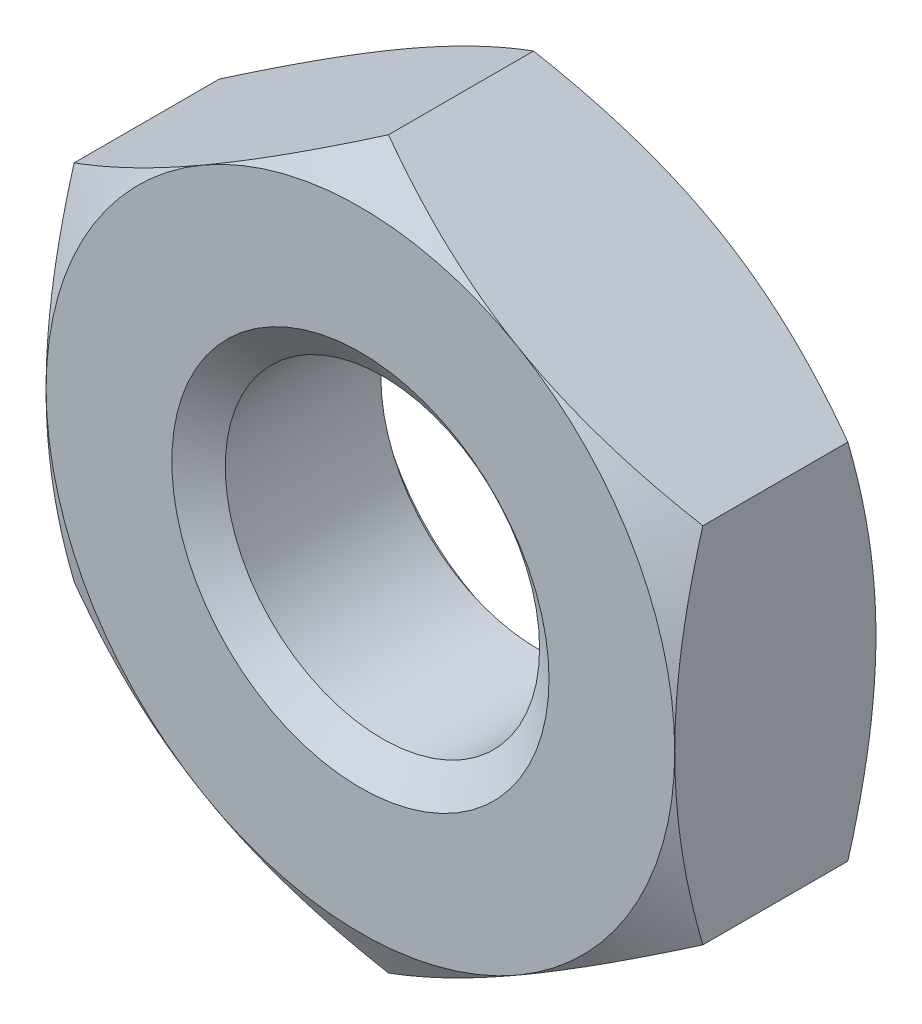
ISO-10303-21;
HEADER;
FILE_DESCRIPTION(('STEP AP214'),'2;1');
FILE_NAME('part.step','',(''),(''),'','','');
FILE_SCHEMA(('AUTOMOTIVE_DESIGN { 1 0 10303 214 1 1 1 1 }'));
ENDSEC;
DATA;
#1=APPLICATION_CONTEXT('core data for automotive mechanical design processes');
#2=APPLICATION_PROTOCOL_DEFINITION('international standard','automotive_design',2000,#1);
#3=PRODUCT_CONTEXT('',#1,'mechanical');
#4=PRODUCT('Part','Part','',(#3));
#5=PRODUCT_RELATED_PRODUCT_CATEGORY('part','',(#4));
#6=PRODUCT_DEFINITION_FORMATION('','',#4);
#7=PRODUCT_DEFINITION_CONTEXT('part definition',#1,'design');
#8=PRODUCT_DEFINITION('design','',#6,#7);
#9=PRODUCT_DEFINITION_SHAPE('','',#8);
#10=(LENGTH_UNIT() NAMED_UNIT(*) SI_UNIT(.MILLI.,.METRE.));
#11=(NAMED_UNIT(*) PLANE_ANGLE_UNIT() SI_UNIT($,.RADIAN.));
#12=(NAMED_UNIT(*) SI_UNIT($,.STERADIAN.) SOLID_ANGLE_UNIT());
#13=UNCERTAINTY_MEASURE_WITH_UNIT(LENGTH_MEASURE(1.E-05),#10,'distance_accuracy_value','');
#14=(GEOMETRIC_REPRESENTATION_CONTEXT(3) GLOBAL_UNCERTAINTY_ASSIGNED_CONTEXT((#13)) GLOBAL_UNIT_ASSIGNED_CONTEXT((#10,
#11,#12)) REPRESENTATION_CONTEXT('',''));
#15=CARTESIAN_POINT('',(0.,0.,0.));
#16=DIRECTION('',(0.,0.,1.));
#17=DIRECTION('',(1.,0.,0.));
#18=AXIS2_PLACEMENT_3D('',#15,#16,#17);
#19=CARTESIAN_POINT('',(0.,0.,-3.2));
#20=DIRECTION('',(0.,0.,1.));
#21=DIRECTION('',(1.,0.,0.));
#22=AXIS2_PLACEMENT_3D('',#19,#20,#21);
#23=CYLINDRICAL_SURFACE('',#22,2.5);
#24=CARTESIAN_POINT('',(0.,0.,-0.350103769104855));
#25=DIRECTION('',(0.,0.,1.));
#26=DIRECTION('',(1.,0.,0.));
#27=AXIS2_PLACEMENT_3D('',#24,#25,#26);
#28=CIRCLE('',#27,2.5);
#29=CARTESIAN_POINT('',(2.5,0.,-0.350103769104855));
#30=VERTEX_POINT('',#29);
#31=EDGE_CURVE('E176',#30,#30,#28,.F.);
#32=ORIENTED_EDGE('',*,*,#31,.F.);
#33=EDGE_LOOP('',(#32));
#34=FACE_BOUND('',#33,.T.);
#35=CARTESIAN_POINT('',(0.,0.,-2.82449623089514));
#36=DIRECTION('',(0.,0.,-1.));
#37=DIRECTION('',(-1.,0.,0.));
#38=AXIS2_PLACEMENT_3D('',#35,#36,#37);
#39=CIRCLE('',#38,2.5);
#40=CARTESIAN_POINT('',(-2.5,0.,-2.82449623089514));
#41=VERTEX_POINT('',#40);
#42=EDGE_CURVE('E41',#41,#41,#39,.F.);
#43=ORIENTED_EDGE('',*,*,#42,.F.);
#44=EDGE_LOOP('',(#43));
#45=FACE_BOUND('',#44,.T.);
#46=ADVANCED_FACE('F36',(#34,#45),#23,.F.);
#47=CARTESIAN_POINT('',(0.,5.77350269189626,-3.2));
#48=DIRECTION('',(0.,0.,-1.));
#49=DIRECTION('',(-1.,0.,0.));
#50=AXIS2_PLACEMENT_3D('',#47,#48,#49);
#51=PLANE('',#50);
#52=CARTESIAN_POINT('',(0.,0.,-3.2));
#53=DIRECTION('',(0.,0.,-1.));
#54=DIRECTION('',(-1.,0.,0.));
#55=AXIS2_PLACEMENT_3D('',#52,#53,#54);
#56=CIRCLE('',#55,5.);
#57=CARTESIAN_POINT('',(-5.,0.,-3.2));
#58=VERTEX_POINT('',#57);
#59=CARTESIAN_POINT('',(-2.5,-4.33012701892219,-3.2));
#60=VERTEX_POINT('',#59);
#61=EDGE_CURVE('E172',#58,#60,#56,.F.);
#62=ORIENTED_EDGE('',*,*,#61,.F.);
#63=CARTESIAN_POINT('',(-2.5,4.33012701892219,-3.2));
#64=VERTEX_POINT('',#63);
#65=EDGE_CURVE('E154',#64,#58,#56,.F.);
#66=ORIENTED_EDGE('',*,*,#65,.F.);
#67=CARTESIAN_POINT('',(2.5,4.33012701892219,-3.2));
#68=VERTEX_POINT('',#67);
#69=EDGE_CURVE('E171',#68,#64,#56,.F.);
#70=ORIENTED_EDGE('',*,*,#69,.F.);
#71=CARTESIAN_POINT('',(0.,0.,-3.2));
#72=DIRECTION('',(0.,0.,1.));
#73=DIRECTION('',(1.,0.,0.));
#74=AXIS2_PLACEMENT_3D('',#71,#72,#73);
#75=CIRCLE('',#74,5.);
#76=CARTESIAN_POINT('',(5.,0.,-3.2));
#77=VERTEX_POINT('',#76);
#78=EDGE_CURVE('E246',#77,#68,#75,.T.);
#79=ORIENTED_EDGE('',*,*,#78,.F.);
#80=CARTESIAN_POINT('',(2.5,-4.33012701892219,-3.2));
#81=VERTEX_POINT('',#80);
#82=EDGE_CURVE('E362',#81,#77,#56,.F.);
#83=ORIENTED_EDGE('',*,*,#82,.F.);
#84=EDGE_CURVE('E366',#60,#81,#56,.F.);
#85=ORIENTED_EDGE('',*,*,#84,.F.);
#86=EDGE_LOOP('',(#62,#66,#70,#79,#83,#85));
#87=FACE_BOUND('',#86,.T.);
#88=CARTESIAN_POINT('',(0.,0.,-3.2));
#89=DIRECTION('',(0.,0.,-1.));
#90=DIRECTION('',(-1.,0.,0.));
#91=AXIS2_PLACEMENT_3D('',#88,#89,#90);
#92=CIRCLE('',#91,3.);
#93=CARTESIAN_POINT('',(-3.,0.,-3.2));
#94=VERTEX_POINT('',#93);
#95=EDGE_CURVE('E179',#94,#94,#92,.F.);
#96=ORIENTED_EDGE('',*,*,#95,.T.);
#97=EDGE_LOOP('',(#96));
#98=FACE_BOUND('',#97,.T.);
#99=ADVANCED_FACE('F299',(#87,#98),#51,.T.);
#100=CARTESIAN_POINT('',(0.,5.77350269189626,0.));
#101=DIRECTION('',(0.,0.,-1.));
#102=DIRECTION('',(-1.,0.,0.));
#103=AXIS2_PLACEMENT_3D('',#100,#101,#102);
#104=PLANE('',#103);
#105=CARTESIAN_POINT('',(0.,0.,0.));
#106=DIRECTION('',(0.,0.,-1.));
#107=DIRECTION('',(-1.,0.,0.));
#108=AXIS2_PLACEMENT_3D('',#105,#106,#107);
#109=CIRCLE('',#108,5.);
#110=CARTESIAN_POINT('',(-5.,0.,0.));
#111=VERTEX_POINT('',#110);
#112=CARTESIAN_POINT('',(-2.5,4.33012701892219,0.));
#113=VERTEX_POINT('',#112);
#114=EDGE_CURVE('E11',#111,#113,#109,.T.);
#115=ORIENTED_EDGE('',*,*,#114,.F.);
#116=CARTESIAN_POINT('',(-2.5,-4.33012701892219,0.));
#117=VERTEX_POINT('',#116);
#118=EDGE_CURVE('E48',#117,#111,#109,.T.);
#119=ORIENTED_EDGE('',*,*,#118,.F.);
#120=CARTESIAN_POINT('',(2.5,-4.33012701892219,0.));
#121=VERTEX_POINT('',#120);
#122=EDGE_CURVE('E175',#121,#117,#109,.T.);
#123=ORIENTED_EDGE('',*,*,#122,.F.);
#124=CARTESIAN_POINT('',(5.,0.,0.));
#125=VERTEX_POINT('',#124);
#126=EDGE_CURVE('E353',#125,#121,#109,.T.);
#127=ORIENTED_EDGE('',*,*,#126,.F.);
#128=CARTESIAN_POINT('',(0.,0.,0.));
#129=DIRECTION('',(0.,0.,1.));
#130=DIRECTION('',(1.,0.,0.));
#131=AXIS2_PLACEMENT_3D('',#128,#129,#130);
#132=CIRCLE('',#131,5.);
#133=CARTESIAN_POINT('',(2.5,4.33012701892219,0.));
#134=VERTEX_POINT('',#133);
#135=EDGE_CURVE('E130',#125,#134,#132,.T.);
#136=ORIENTED_EDGE('',*,*,#135,.T.);
#137=EDGE_CURVE('E46',#113,#134,#109,.T.);
#138=ORIENTED_EDGE('',*,*,#137,.F.);
#139=EDGE_LOOP('',(#115,#119,#123,#127,#136,#138));
#140=FACE_BOUND('',#139,.T.);
#141=CARTESIAN_POINT('',(0.,0.,0.));
#142=DIRECTION('',(0.,0.,1.));
#143=DIRECTION('',(1.,0.,0.));
#144=AXIS2_PLACEMENT_3D('',#141,#142,#143);
#145=CIRCLE('',#144,3.);
#146=CARTESIAN_POINT('',(3.,0.,0.));
#147=VERTEX_POINT('',#146);
#148=EDGE_CURVE('E178',#147,#147,#145,.T.);
#149=ORIENTED_EDGE('',*,*,#148,.F.);
#150=EDGE_LOOP('',(#149));
#151=FACE_BOUND('',#150,.T.);
#152=ADVANCED_FACE('F251',(#140,#151),#104,.F.);
#153=CARTESIAN_POINT('',(0.,5.77350269189626,-3.2));
#154=DIRECTION('',(-0.500000000000001,0.866025403784438,0.));
#155=DIRECTION('',(-0.866025403784438,-0.500000000000001,0.));
#156=AXIS2_PLACEMENT_3D('',#153,#154,#155);
#157=PLANE('',#156);
#158=DIRECTION('',(0.,0.,1.));
#159=VECTOR('',#158,1.);
#160=CARTESIAN_POINT('',(-5.,2.88675134594813,-3.2));
#161=LINE('',#160,#159);
#162=CARTESIAN_POINT('',(-5.,2.88675134594813,-2.75341801261479));
#163=VERTEX_POINT('',#162);
#164=CARTESIAN_POINT('',(-5.,2.88675134594813,-0.446581987385205));
#165=VERTEX_POINT('',#164);
#166=EDGE_CURVE('E166',#163,#165,#161,.T.);
#167=ORIENTED_EDGE('',*,*,#166,.T.);
#168=CARTESIAN_POINT('',(-5.0002,2.88663587589429,-0.446648656051832));
#169=CARTESIAN_POINT('',(-4.78046540547481,3.01349970319368,-0.373386567637637));
#170=CARTESIAN_POINT('',(-4.55885141554042,3.14144859993849,-0.306751321918094));
#171=CARTESIAN_POINT('',(-4.11178600454649,3.39956193532121,-0.190438991010811));
#172=CARTESIAN_POINT('',(-3.88632664040923,3.52973095989718,-0.140803049915789));
#173=CARTESIAN_POINT('',(-3.43816769477649,3.78847564779798,-0.0635510254186975));
#174=CARTESIAN_POINT('',(-3.21553790689581,3.91701101576052,-0.0354203782834889));
#175=CARTESIAN_POINT('',(-2.88081009815336,4.11026620624323,-0.010194921953684));
#176=CARTESIAN_POINT('',(-2.76915780319494,4.17472868879311,-0.00461345976948341));
#177=CARTESIAN_POINT('',(-2.5457500293262,4.30371322717528,0.000797783248530168));
#178=CARTESIAN_POINT('',(-2.43399455370968,4.36823528110589,0.000627741741796764));
#179=CARTESIAN_POINT('',(-2.12781576914936,4.54500768479195,-0.00775363179203697));
#180=CARTESIAN_POINT('',(-1.93349391403278,4.65719946015293,-0.0218297718972522));
#181=CARTESIAN_POINT('',(-1.54613989800229,4.88083840557981,-0.0664652571094323));
#182=CARTESIAN_POINT('',(-1.35310909862843,4.9922847895602,-0.0970398601475101));
#183=CARTESIAN_POINT('',(-0.964974657525144,5.21637431361295,-0.173468493621167));
#184=CARTESIAN_POINT('',(-0.769920001358263,5.32898917185759,-0.219646378878683));
#185=CARTESIAN_POINT('',(-0.382719654641231,5.55253939626498,-0.324451794491938));
#186=CARTESIAN_POINT('',(-0.190569004591913,5.66347762579592,-0.383054703437379));
#187=CARTESIAN_POINT('',(0.000199999999999885,5.7736181619501,-0.446648656051834));
#188=B_SPLINE_CURVE_WITH_KNOTS('',3,(#168,#169,#170,#171,#172,#173,#174,#175,#176,#177,#178,
#179,#180,#181,#182,#183,#184,#185,#186,#187),.UNSPECIFIED.,.F.,.F.,(4,2,2,2,2,2,2,2,2,4),(0.,
0.792555841363092,1.58701660053334,2.36181537487281,2.74884076077326,3.13585419177295,
3.8096236259968,4.4840172390119,5.17336882348929,5.86136694793726),.UNSPECIFIED.);
#189=EDGE_CURVE('E135',#165,#113,#188,.T.);
#190=ORIENTED_EDGE('',*,*,#189,.T.);
#191=CARTESIAN_POINT('',(0.,5.77350269189626,-0.446581987385208));
#192=VERTEX_POINT('',#191);
#193=EDGE_CURVE('E55',#113,#192,#188,.T.);
#194=ORIENTED_EDGE('',*,*,#193,.T.);
#195=DIRECTION('',(0.,0.,1.));
#196=VECTOR('',#195,1.);
#197=CARTESIAN_POINT('',(0.,5.77350269189626,-3.2));
#198=LINE('',#197,#196);
#199=CARTESIAN_POINT('',(0.,5.77350269189626,-2.75341801261479));
#200=VERTEX_POINT('',#199);
#201=EDGE_CURVE('E151',#200,#192,#198,.T.);
#202=ORIENTED_EDGE('',*,*,#201,.F.);
#203=CARTESIAN_POINT('',(-5.0002,2.88663587589429,-2.75335134394817));
#204=CARTESIAN_POINT('',(-4.78046540547481,3.01349970319368,-2.82661343236236));
#205=CARTESIAN_POINT('',(-4.55885141554042,3.14144859993849,-2.89324867808191));
#206=CARTESIAN_POINT('',(-4.11178600454649,3.39956193532121,-3.00956100898919));
#207=CARTESIAN_POINT('',(-3.88632664040923,3.52973095989718,-3.05919695008421));
#208=CARTESIAN_POINT('',(-3.43816769477649,3.78847564779798,-3.1364489745813));
#209=CARTESIAN_POINT('',(-3.2155379068958,3.91701101576052,-3.16457962171651));
#210=CARTESIAN_POINT('',(-2.88081009815336,4.11026620624323,-3.18980507804632));
#211=CARTESIAN_POINT('',(-2.76915780319494,4.17472868879311,-3.19538654023052));
#212=CARTESIAN_POINT('',(-2.5457500293262,4.30371322717528,-3.20079778324853));
#213=CARTESIAN_POINT('',(-2.43399455370968,4.36823528110589,-3.2006277417418));
#214=CARTESIAN_POINT('',(-2.12781576914936,4.54500768479194,-3.19224636820796));
#215=CARTESIAN_POINT('',(-1.93349391403278,4.65719946015293,-3.17817022810275));
#216=CARTESIAN_POINT('',(-1.54613989800229,4.88083840557981,-3.13353474289057));
#217=CARTESIAN_POINT('',(-1.35310909862843,4.99228478956021,-3.10296013985249));
#218=CARTESIAN_POINT('',(-0.964974657525144,5.21637431361295,-3.02653150637883));
#219=CARTESIAN_POINT('',(-0.769920001358263,5.32898917185759,-2.98035362112132));
#220=CARTESIAN_POINT('',(-0.382719654641231,5.55253939626498,-2.87554820550806));
#221=CARTESIAN_POINT('',(-0.190569004591913,5.66347762579592,-2.81694529656262));
#222=CARTESIAN_POINT('',(0.000199999999999887,5.7736181619501,-2.75335134394817));
#223=B_SPLINE_CURVE_WITH_KNOTS('',3,(#203,#204,#205,#206,#207,#208,#209,#210,#211,#212,#213,
#214,#215,#216,#217,#218,#219,#220,#221,#222),.UNSPECIFIED.,.F.,.F.,(4,2,2,2,2,2,2,2,2,4),(0.,
0.792555841363092,1.58701660053334,2.36181537487281,2.74884076077326,3.13585419177295,
3.8096236259968,4.4840172390119,5.17336882348929,5.86136694793726),.UNSPECIFIED.);
#224=EDGE_CURVE('E169',#64,#200,#223,.T.);
#225=ORIENTED_EDGE('',*,*,#224,.F.);
#226=EDGE_CURVE('E261',#163,#64,#223,.T.);
#227=ORIENTED_EDGE('',*,*,#226,.F.);
#228=EDGE_LOOP('',(#167,#190,#194,#202,#225,#227));
#229=FACE_BOUND('',#228,.T.);
#230=ADVANCED_FACE('F38',(#229),#157,.T.);
#231=CARTESIAN_POINT('',(5.,2.88675134594813,-3.2));
#232=DIRECTION('',(0.500000000000001,0.866025403784438,0.));
#233=DIRECTION('',(-0.866025403784438,0.500000000000001,0.));
#234=AXIS2_PLACEMENT_3D('',#231,#232,#233);
#235=PLANE('',#234);
#236=ORIENTED_EDGE('',*,*,#201,.T.);
#237=CARTESIAN_POINT('',(-0.000199999999999944,5.7736181619501,-0.446648656051834));
#238=CARTESIAN_POINT('',(0.219534594525186,5.64675433465071,-0.37338656763764));
#239=CARTESIAN_POINT('',(0.441148584459581,5.5188054379059,-0.306751321918096));
#240=CARTESIAN_POINT('',(0.888213995453514,5.26069210252318,-0.190438991010813));
#241=CARTESIAN_POINT('',(1.11367335959078,5.13052307794721,-0.140803049915791));
#242=CARTESIAN_POINT('',(1.56183230522351,4.87177839004641,-0.0635510254186984));
#243=CARTESIAN_POINT('',(1.78446209310419,4.74324302208387,-0.0354203782834895));
#244=CARTESIAN_POINT('',(2.11918990184664,4.54998783160116,-0.0101949219536846));
#245=CARTESIAN_POINT('',(2.23084219680506,4.48552534905128,-0.00461345976948414));
#246=CARTESIAN_POINT('',(2.4542499706738,4.35654081066911,0.000797783248529637));
#247=CARTESIAN_POINT('',(2.56600544629032,4.2920187567385,0.00062774174179657));
#248=CARTESIAN_POINT('',(2.87218423085064,4.11524635305244,-0.00775363179203664));
#249=CARTESIAN_POINT('',(3.06650608596722,4.00305457769146,-0.021829771897252));
#250=CARTESIAN_POINT('',(3.45386010199771,3.77941563226457,-0.0664652571094318));
#251=CARTESIAN_POINT('',(3.64689090137157,3.66796924828418,-0.0970398601475091));
#252=CARTESIAN_POINT('',(4.03502534247486,3.44387972423144,-0.173468493621165));
#253=CARTESIAN_POINT('',(4.23007999864174,3.3312648659868,-0.219646378878682));
#254=CARTESIAN_POINT('',(4.61728034535877,3.1077146415794,-0.324451794491937));
#255=CARTESIAN_POINT('',(4.80943099540809,2.99677641204847,-0.383054703437377));
#256=CARTESIAN_POINT('',(5.0002,2.88663587589429,-0.446648656051832));
#257=B_SPLINE_CURVE_WITH_KNOTS('',3,(#237,#238,#239,#240,#241,#242,#243,#244,#245,#246,#247,
#248,#249,#250,#251,#252,#253,#254,#255,#256),.UNSPECIFIED.,.F.,.F.,(4,2,2,2,2,2,2,2,2,4),(0.,
0.792555841363092,1.58701660053334,2.36181537487281,2.74884076077326,3.13585419177296,
3.8096236259968,4.4840172390119,5.17336882348929,5.86136694793726),.UNSPECIFIED.);
#258=EDGE_CURVE('E145',#192,#134,#257,.T.);
#259=ORIENTED_EDGE('',*,*,#258,.T.);
#260=CARTESIAN_POINT('',(5.,2.88675134594813,-0.446581987385208));
#261=VERTEX_POINT('',#260);
#262=EDGE_CURVE('E62',#134,#261,#257,.T.);
#263=ORIENTED_EDGE('',*,*,#262,.T.);
#264=DIRECTION('',(0.,0.,1.));
#265=VECTOR('',#264,1.);
#266=CARTESIAN_POINT('',(5.,2.88675134594813,-3.2));
#267=LINE('',#266,#265);
#268=CARTESIAN_POINT('',(5.,2.88675134594813,-2.75341801261479));
#269=VERTEX_POINT('',#268);
#270=EDGE_CURVE('E144',#269,#261,#267,.T.);
#271=ORIENTED_EDGE('',*,*,#270,.F.);
#272=CARTESIAN_POINT('',(-0.00019999999999993,5.7736181619501,-2.75335134394817));
#273=CARTESIAN_POINT('',(0.219534594525186,5.64675433465071,-2.82661343236236));
#274=CARTESIAN_POINT('',(0.441148584459581,5.5188054379059,-2.8932486780819));
#275=CARTESIAN_POINT('',(0.888213995453514,5.26069210252318,-3.00956100898919));
#276=CARTESIAN_POINT('',(1.11367335959078,5.13052307794721,-3.05919695008421));
#277=CARTESIAN_POINT('',(1.56183230522351,4.87177839004641,-3.1364489745813));
#278=CARTESIAN_POINT('',(1.78446209310419,4.74324302208387,-3.16457962171651));
#279=CARTESIAN_POINT('',(2.11918990184664,4.54998783160116,-3.18980507804632));
#280=CARTESIAN_POINT('',(2.23084219680506,4.48552534905128,-3.19538654023052));
#281=CARTESIAN_POINT('',(2.4542499706738,4.35654081066911,-3.20079778324853));
#282=CARTESIAN_POINT('',(2.56600544629032,4.2920187567385,-3.2006277417418));
#283=CARTESIAN_POINT('',(2.87218423085064,4.11524635305244,-3.19224636820796));
#284=CARTESIAN_POINT('',(3.06650608596722,4.00305457769146,-3.17817022810275));
#285=CARTESIAN_POINT('',(3.45386010199771,3.77941563226457,-3.13353474289057));
#286=CARTESIAN_POINT('',(3.64689090137157,3.66796924828418,-3.10296013985249));
#287=CARTESIAN_POINT('',(4.03502534247486,3.44387972423144,-3.02653150637884));
#288=CARTESIAN_POINT('',(4.23007999864174,3.3312648659868,-2.98035362112132));
#289=CARTESIAN_POINT('',(4.61728034535877,3.1077146415794,-2.87554820550806));
#290=CARTESIAN_POINT('',(4.80943099540809,2.99677641204847,-2.81694529656262));
#291=CARTESIAN_POINT('',(5.0002,2.88663587589429,-2.75335134394817));
#292=B_SPLINE_CURVE_WITH_KNOTS('',3,(#272,#273,#274,#275,#276,#277,#278,#279,#280,#281,#282,
#283,#284,#285,#286,#287,#288,#289,#290,#291),.UNSPECIFIED.,.F.,.F.,(4,2,2,2,2,2,2,2,2,4),(0.,
0.792555841363092,1.58701660053334,2.36181537487281,2.74884076077326,3.13585419177296,
3.8096236259968,4.4840172390119,5.17336882348929,5.86136694793726),.UNSPECIFIED.);
#293=EDGE_CURVE('E255',#68,#269,#292,.T.);
#294=ORIENTED_EDGE('',*,*,#293,.F.);
#295=EDGE_CURVE('E260',#200,#68,#292,.T.);
#296=ORIENTED_EDGE('',*,*,#295,.F.);
#297=EDGE_LOOP('',(#236,#259,#263,#271,#294,#296));
#298=FACE_BOUND('',#297,.T.);
#299=ADVANCED_FACE('F142',(#298),#235,.T.);
#300=CARTESIAN_POINT('',(5.,2.88675134594813,-3.2));
#301=DIRECTION('',(-1.,0.,0.));
#302=DIRECTION('',(0.,0.,1.));
#303=AXIS2_PLACEMENT_3D('',#300,#301,#302);
#304=PLANE('',#303);
#305=CARTESIAN_POINT('',(5.,-7.65608998744865,-2.39263352655081));
#306=CARTESIAN_POINT('',(5.,-7.43656171400166,-2.28654533817208));
#307=CARTESIAN_POINT('',(5.,-7.21651440170022,-2.18151175461596));
#308=CARTESIAN_POINT('',(5.,-6.77510105921518,-1.97415643363977));
#309=CARTESIAN_POINT('',(5.,-6.55373480873053,-1.87183516574569));
#310=CARTESIAN_POINT('',(5.,-6.10820714710357,-1.66996807853491));
#311=CARTESIAN_POINT('',(5.,-5.88403698971124,-1.57044149281731));
#312=CARTESIAN_POINT('',(5.,-5.43385418074677,-1.37566323278682));
#313=CARTESIAN_POINT('',(5.,-5.20784162594278,-1.28041133564243));
#314=CARTESIAN_POINT('',(5.,-4.75080884782756,-1.09418830918942));
#315=CARTESIAN_POINT('',(5.,-4.51976121099505,-1.0032840909987));
#316=CARTESIAN_POINT('',(5.,-4.054940534221,-0.828595302971952));
#317=CARTESIAN_POINT('',(5.,-3.82116719434025,-0.744811525247655));
#318=CARTESIAN_POINT('',(5.,-3.35100416711889,-0.586614632364621));
#319=CARTESIAN_POINT('',(5.,-3.11462125088188,-0.512181595225273));
#320=CARTESIAN_POINT('',(5.,-2.63849247870023,-0.375104393872379));
#321=CARTESIAN_POINT('',(5.,-2.3987477121033,-0.31245650159695));
#322=CARTESIAN_POINT('',(5.,-1.91574303714497,-0.201987753994869));
#323=CARTESIAN_POINT('',(5.,-1.672482210841,-0.154170846558642));
#324=CARTESIAN_POINT('',(5.,-1.18299359688664,-0.0765955557924025));
#325=CARTESIAN_POINT('',(5.,-0.936765806613279,-0.0468371884284092));
#326=CARTESIAN_POINT('',(5.,-0.567032279323846,-0.0176512015862964));
#327=CARTESIAN_POINT('',(5.,-0.444105297658538,-0.0104963190599469));
#328=CARTESIAN_POINT('',(5.,-0.198053005238564,-0.00139545226904072));
#329=CARTESIAN_POINT('',(5.,-0.0749276970802274,0.000550599639614562));
#330=CARTESIAN_POINT('',(5.,0.171257999892354,-0.000818470345664083));
#331=CARTESIAN_POINT('',(5.,0.29431839722709,-0.00413211431301174));
#332=CARTESIAN_POINT('',(5.,0.540192730788842,-0.0159365972827602));
#333=CARTESIAN_POINT('',(5.,0.663006654263485,-0.0244276975701652));
#334=CARTESIAN_POINT('',(5.,0.960681872881669,-0.0511063802753011));
#335=CARTESIAN_POINT('',(5.,1.1353143627994,-0.0718889676982867));
#336=CARTESIAN_POINT('',(5.,1.48321675799389,-0.122765655722696));
#337=CARTESIAN_POINT('',(5.,1.65648647841236,-0.152860997990035));
#338=CARTESIAN_POINT('',(5.,2.00155426058699,-0.221298792011552));
#339=CARTESIAN_POINT('',(5.,2.17335067370373,-0.259649477486405));
#340=CARTESIAN_POINT('',(5.,2.51518168221054,-0.343428305385012));
#341=CARTESIAN_POINT('',(5.,2.6852163841931,-0.388856016914002));
#342=CARTESIAN_POINT('',(5.,3.02770318928892,-0.486887782054293));
#343=CARTESIAN_POINT('',(5.,3.20011248435311,-0.539640363823942));
#344=CARTESIAN_POINT('',(5.,3.54310870430176,-0.650357787302626));
#345=CARTESIAN_POINT('',(5.,3.71369679659714,-0.70831903390707));
#346=CARTESIAN_POINT('',(5.,4.05236610267973,-0.828256540728473));
#347=CARTESIAN_POINT('',(5.,4.22045602230055,-0.890208365426365));
#348=CARTESIAN_POINT('',(5.,4.55533171687448,-1.01774823413812));
#349=CARTESIAN_POINT('',(5.,4.72211693321414,-1.08333774778777));
#350=CARTESIAN_POINT('',(5.,4.88829623733355,-1.15038625817724));
#351=B_SPLINE_CURVE_WITH_KNOTS('',3,(#305,#306,#307,#308,#309,#310,#311,#312,#313,#314,#315,
#316,#317,#318,#319,#320,#321,#322,#323,#324,#325,#326,#327,#328,#329,#330,#331,#332,#333,#334,
#335,#336,#337,#338,#339,#340,#341,#342,#343,#344,#345,#346,#347,#348,#349,#350),.UNSPECIFIED.,
.F.,.F.,(4,2,2,2,2,2,2,2,2,2,2,2,2,2,2,2,2,2,2,2,2,2,4),(0.,0.731464740665351,1.46305528824908,
2.19883243307486,2.93457117856034,3.67934251246858,4.42419659013361,5.1674358087199,
5.91043951739339,6.65364083834807,7.39684281638516,7.76615414335457,8.13546067426611,
8.50466345177856,8.87388486298453,9.40118542949727,9.92855633110015,10.4564556797854,
10.9843228991235,11.525120280828,12.065547221064,12.6029322754131,13.1405360390026),.UNSPECIFIED.);
#352=CARTESIAN_POINT('',(5.,-2.88675134594813,-0.446581987385208));
#353=VERTEX_POINT('',#352);
#354=EDGE_CURVE('E137',#353,#125,#351,.T.);
#355=ORIENTED_EDGE('',*,*,#354,.F.);
#356=DIRECTION('',(0.,0.,1.));
#357=VECTOR('',#356,1.);
#358=CARTESIAN_POINT('',(5.,-2.88675134594813,-3.2));
#359=LINE('',#358,#357);
#360=CARTESIAN_POINT('',(5.,-2.88675134594813,-2.75341801261479));
#361=VERTEX_POINT('',#360);
#362=EDGE_CURVE('E152',#361,#353,#359,.T.);
#363=ORIENTED_EDGE('',*,*,#362,.F.);
#364=CARTESIAN_POINT('',(5.,-7.65608998744865,-0.807366473449195));
#365=CARTESIAN_POINT('',(5.,-7.43656171400166,-0.913454661827922));
#366=CARTESIAN_POINT('',(5.,-7.21651440170022,-1.01848824538404));
#367=CARTESIAN_POINT('',(5.,-6.77510105921518,-1.22584356636023));
#368=CARTESIAN_POINT('',(5.,-6.55373480873052,-1.32816483425431));
#369=CARTESIAN_POINT('',(5.,-6.10820714710357,-1.53003192146509));
#370=CARTESIAN_POINT('',(5.,-5.88403698971124,-1.62955850718269));
#371=CARTESIAN_POINT('',(5.,-5.43385418074677,-1.82433676721318));
#372=CARTESIAN_POINT('',(5.,-5.20784162594278,-1.91958866435757));
#373=CARTESIAN_POINT('',(5.,-4.75080884782756,-2.10581169081058));
#374=CARTESIAN_POINT('',(5.,-4.51976121099505,-2.1967159090013));
#375=CARTESIAN_POINT('',(5.,-4.05494053422099,-2.37140469702805));
#376=CARTESIAN_POINT('',(5.,-3.82116719434025,-2.45518847475235));
#377=CARTESIAN_POINT('',(5.,-3.35100416711889,-2.61338536763538));
#378=CARTESIAN_POINT('',(5.,-3.11462125088188,-2.68781840477473));
#379=CARTESIAN_POINT('',(5.,-2.63849247870023,-2.82489560612762));
#380=CARTESIAN_POINT('',(5.,-2.3987477121033,-2.88754349840305));
#381=CARTESIAN_POINT('',(5.,-1.91574303714497,-2.99801224600513));
#382=CARTESIAN_POINT('',(5.,-1.672482210841,-3.04582915344136));
#383=CARTESIAN_POINT('',(5.,-1.18299359688664,-3.1234044442076));
#384=CARTESIAN_POINT('',(5.,-0.936765806613281,-3.15316281157159));
#385=CARTESIAN_POINT('',(5.,-0.567032279323847,-3.1823487984137));
#386=CARTESIAN_POINT('',(5.,-0.444105297658539,-3.18950368094005));
#387=CARTESIAN_POINT('',(5.,-0.198053005238564,-3.19860454773096));
#388=CARTESIAN_POINT('',(5.,-0.0749276970802276,-3.20055059963961));
#389=CARTESIAN_POINT('',(5.,0.171257999892354,-3.19918152965434));
#390=CARTESIAN_POINT('',(5.,0.294318397227089,-3.19586788568699));
#391=CARTESIAN_POINT('',(5.,0.540192730788842,-3.18406340271724));
#392=CARTESIAN_POINT('',(5.,0.663006654263486,-3.17557230242983));
#393=CARTESIAN_POINT('',(5.,0.960681872881669,-3.1488936197247));
#394=CARTESIAN_POINT('',(5.,1.1353143627994,-3.12811103230171));
#395=CARTESIAN_POINT('',(5.,1.48321675799389,-3.0772343442773));
#396=CARTESIAN_POINT('',(5.,1.65648647841236,-3.04713900200997));
#397=CARTESIAN_POINT('',(5.,2.00155426058699,-2.97870120798845));
#398=CARTESIAN_POINT('',(5.,2.17335067370373,-2.9403505225136));
#399=CARTESIAN_POINT('',(5.,2.51518168221054,-2.85657169461499));
#400=CARTESIAN_POINT('',(5.,2.6852163841931,-2.811143983086));
#401=CARTESIAN_POINT('',(5.,3.02770318928892,-2.71311221794571));
#402=CARTESIAN_POINT('',(5.,3.20011248435311,-2.66035963617606));
#403=CARTESIAN_POINT('',(5.,3.54310870430176,-2.54964221269737));
#404=CARTESIAN_POINT('',(5.,3.71369679659714,-2.49168096609293));
#405=CARTESIAN_POINT('',(5.,4.05236610267973,-2.37174345927153));
#406=CARTESIAN_POINT('',(5.,4.22045602230055,-2.30979163457364));
#407=CARTESIAN_POINT('',(5.,4.55533171687448,-2.18225176586188));
#408=CARTESIAN_POINT('',(5.,4.72211693321414,-2.11666225221223));
#409=CARTESIAN_POINT('',(5.,4.88829623733355,-2.04961374182276));
#410=B_SPLINE_CURVE_WITH_KNOTS('',3,(#364,#365,#366,#367,#368,#369,#370,#371,#372,#373,#374,
#375,#376,#377,#378,#379,#380,#381,#382,#383,#384,#385,#386,#387,#388,#389,#390,#391,#392,#393,
#394,#395,#396,#397,#398,#399,#400,#401,#402,#403,#404,#405,#406,#407,#408,#409),.UNSPECIFIED.,
.F.,.F.,(4,2,2,2,2,2,2,2,2,2,2,2,2,2,2,2,2,2,2,2,2,2,4),(0.,0.731464740665352,1.46305528824909,
2.19883243307486,2.93457117856034,3.67934251246858,4.42419659013362,5.1674358087199,
5.91043951739339,6.65364083834806,7.39684281638516,7.76615414335457,8.13546067426611,
8.50466345177856,8.87388486298453,9.40118542949728,9.92855633110015,10.4564556797854,
10.9843228991235,11.525120280828,12.065547221064,12.6029322754131,13.1405360390026),.UNSPECIFIED.);
#411=EDGE_CURVE('E267',#361,#77,#410,.T.);
#412=ORIENTED_EDGE('',*,*,#411,.T.);
#413=EDGE_CURVE('E150',#77,#269,#410,.T.);
#414=ORIENTED_EDGE('',*,*,#413,.T.);
#415=ORIENTED_EDGE('',*,*,#270,.T.);
#416=EDGE_CURVE('E127',#125,#261,#351,.T.);
#417=ORIENTED_EDGE('',*,*,#416,.F.);
#418=EDGE_LOOP('',(#355,#363,#412,#414,#415,#417));
#419=FACE_BOUND('',#418,.T.);
#420=ADVANCED_FACE('F148',(#419),#304,.F.);
#421=CARTESIAN_POINT('',(0.,-5.77350269189627,-3.2));
#422=DIRECTION('',(0.500000000000001,-0.866025403784438,0.));
#423=DIRECTION('',(0.866025403784438,0.500000000000001,0.));
#424=AXIS2_PLACEMENT_3D('',#421,#422,#423);
#425=PLANE('',#424);
#426=ORIENTED_EDGE('',*,*,#362,.T.);
#427=CARTESIAN_POINT('',(5.0002,-2.8866358758943,-0.446648656051834));
#428=CARTESIAN_POINT('',(4.78046540547481,-3.01349970319368,-0.373386567637639));
#429=CARTESIAN_POINT('',(4.55885141554042,-3.14144859993849,-0.306751321918095));
#430=CARTESIAN_POINT('',(4.11178600454648,-3.39956193532121,-0.190438991010813));
#431=CARTESIAN_POINT('',(3.88632664040922,-3.52973095989718,-0.140803049915791));
#432=CARTESIAN_POINT('',(3.43816769477649,-3.78847564779798,-0.0635510254186998));
#433=CARTESIAN_POINT('',(3.2155379068958,-3.91701101576052,-0.0354203782834916));
#434=CARTESIAN_POINT('',(2.88081009815335,-4.11026620624323,-0.0101949219536866));
#435=CARTESIAN_POINT('',(2.76915780319494,-4.17472868879311,-0.00461345976948596));
#436=CARTESIAN_POINT('',(2.5457500293262,-4.30371322717528,0.000797783248527456));
#437=CARTESIAN_POINT('',(2.43399455370968,-4.3682352811059,0.000627741741793833));
#438=CARTESIAN_POINT('',(2.12781576914936,-4.54500768479195,-0.00775363179204044));
#439=CARTESIAN_POINT('',(1.93349391403278,-4.65719946015293,-0.021829771897256));
#440=CARTESIAN_POINT('',(1.54613989800229,-4.88083840557982,-0.0664652571094358));
#441=CARTESIAN_POINT('',(1.35310909862843,-4.99228478956021,-0.0970398601475132));
#442=CARTESIAN_POINT('',(0.964974657525143,-5.21637431361296,-0.17346849362117));
#443=CARTESIAN_POINT('',(0.769920001358262,-5.3289891718576,-0.219646378878687));
#444=CARTESIAN_POINT('',(0.38271965464123,-5.55253939626499,-0.324451794491942));
#445=CARTESIAN_POINT('',(0.190569004591913,-5.66347762579593,-0.383054703437383));
#446=CARTESIAN_POINT('',(-0.000200000000000091,-5.7736181619501,-0.446648656051837));
#447=B_SPLINE_CURVE_WITH_KNOTS('',3,(#427,#428,#429,#430,#431,#432,#433,#434,#435,#436,#437,
#438,#439,#440,#441,#442,#443,#444,#445,#446),.UNSPECIFIED.,.F.,.F.,(4,2,2,2,2,2,2,2,2,4),(0.,
0.792555841363093,1.58701660053334,2.36181537487281,2.74884076077326,3.13585419177295,
3.8096236259968,4.4840172390119,5.17336882348929,5.86136694793725),.UNSPECIFIED.);
#448=EDGE_CURVE('E348',#353,#121,#447,.T.);
#449=ORIENTED_EDGE('',*,*,#448,.T.);
#450=CARTESIAN_POINT('',(0.,-5.77350269189626,-0.446581987385208));
#451=VERTEX_POINT('',#450);
#452=EDGE_CURVE('E227',#121,#451,#447,.T.);
#453=ORIENTED_EDGE('',*,*,#452,.T.);
#454=DIRECTION('',(0.,0.,1.));
#455=VECTOR('',#454,1.);
#456=CARTESIAN_POINT('',(0.,-5.77350269189627,-3.2));
#457=LINE('',#456,#455);
#458=CARTESIAN_POINT('',(0.,-5.77350269189626,-2.75341801261479));
#459=VERTEX_POINT('',#458);
#460=EDGE_CURVE('E157',#459,#451,#457,.T.);
#461=ORIENTED_EDGE('',*,*,#460,.F.);
#462=CARTESIAN_POINT('',(5.0002,-2.8866358758943,-2.75335134394817));
#463=CARTESIAN_POINT('',(4.78046540547481,-3.01349970319368,-2.82661343236236));
#464=CARTESIAN_POINT('',(4.55885141554042,-3.14144859993849,-2.8932486780819));
#465=CARTESIAN_POINT('',(4.11178600454648,-3.39956193532121,-3.00956100898919));
#466=CARTESIAN_POINT('',(3.88632664040922,-3.52973095989718,-3.05919695008421));
#467=CARTESIAN_POINT('',(3.43816769477649,-3.78847564779798,-3.1364489745813));
#468=CARTESIAN_POINT('',(3.2155379068958,-3.91701101576052,-3.16457962171651));
#469=CARTESIAN_POINT('',(2.88081009815335,-4.11026620624323,-3.18980507804631));
#470=CARTESIAN_POINT('',(2.76915780319494,-4.17472868879311,-3.19538654023051));
#471=CARTESIAN_POINT('',(2.5457500293262,-4.30371322717528,-3.20079778324853));
#472=CARTESIAN_POINT('',(2.43399455370968,-4.3682352811059,-3.20062774174179));
#473=CARTESIAN_POINT('',(2.12781576914936,-4.54500768479195,-3.19224636820796));
#474=CARTESIAN_POINT('',(1.93349391403278,-4.65719946015293,-3.17817022810274));
#475=CARTESIAN_POINT('',(1.54613989800229,-4.88083840557982,-3.13353474289056));
#476=CARTESIAN_POINT('',(1.35310909862843,-4.99228478956021,-3.10296013985249));
#477=CARTESIAN_POINT('',(0.964974657525143,-5.21637431361296,-3.02653150637883));
#478=CARTESIAN_POINT('',(0.769920001358262,-5.3289891718576,-2.98035362112131));
#479=CARTESIAN_POINT('',(0.38271965464123,-5.55253939626499,-2.87554820550806));
#480=CARTESIAN_POINT('',(0.190569004591913,-5.66347762579593,-2.81694529656262));
#481=CARTESIAN_POINT('',(-0.000200000000000087,-5.7736181619501,-2.75335134394816));
#482=B_SPLINE_CURVE_WITH_KNOTS('',3,(#462,#463,#464,#465,#466,#467,#468,#469,#470,#471,#472,
#473,#474,#475,#476,#477,#478,#479,#480,#481),.UNSPECIFIED.,.F.,.F.,(4,2,2,2,2,2,2,2,2,4),(0.,
0.792555841363093,1.58701660053334,2.36181537487281,2.74884076077326,3.13585419177295,
3.8096236259968,4.4840172390119,5.17336882348929,5.86136694793726),.UNSPECIFIED.);
#483=EDGE_CURVE('E273',#81,#459,#482,.T.);
#484=ORIENTED_EDGE('',*,*,#483,.F.);
#485=EDGE_CURVE('E272',#361,#81,#482,.T.);
#486=ORIENTED_EDGE('',*,*,#485,.F.);
#487=EDGE_LOOP('',(#426,#449,#453,#461,#484,#486));
#488=FACE_BOUND('',#487,.T.);
#489=ADVANCED_FACE('F283',(#488),#425,.T.);
#490=CARTESIAN_POINT('',(-5.,-2.88675134594813,-3.2));
#491=DIRECTION('',(-0.500000000000001,-0.866025403784438,0.));
#492=DIRECTION('',(0.866025403784438,-0.500000000000001,0.));
#493=AXIS2_PLACEMENT_3D('',#490,#491,#492);
#494=PLANE('',#493);
#495=ORIENTED_EDGE('',*,*,#460,.T.);
#496=CARTESIAN_POINT('',(0.000199999999999675,-5.7736181619501,-0.446648656051837));
#497=CARTESIAN_POINT('',(-0.219534594525186,-5.64675433465071,-0.373386567637642));
#498=CARTESIAN_POINT('',(-0.441148584459582,-5.5188054379059,-0.306751321918099));
#499=CARTESIAN_POINT('',(-0.888213995453516,-5.26069210252319,-0.190438991010816));
#500=CARTESIAN_POINT('',(-1.11367335959078,-5.13052307794722,-0.140803049915793));
#501=CARTESIAN_POINT('',(-1.56183230522351,-4.87177839004641,-0.0635510254187014));
#502=CARTESIAN_POINT('',(-1.7844620931042,-4.74324302208387,-0.0354203782834928));
#503=CARTESIAN_POINT('',(-2.11918990184665,-4.54998783160117,-0.0101949219536873));
#504=CARTESIAN_POINT('',(-2.23084219680507,-4.48552534905128,-0.00461345976948643));
#505=CARTESIAN_POINT('',(-2.4542499706738,-4.35654081066911,0.000797783248527422));
#506=CARTESIAN_POINT('',(-2.56600544629032,-4.2920187567385,0.000627741741794034));
#507=CARTESIAN_POINT('',(-2.87218423085065,-4.11524635305245,-0.00775363179203975));
#508=CARTESIAN_POINT('',(-3.06650608596722,-4.00305457769146,-0.0218297718972551));
#509=CARTESIAN_POINT('',(-3.45386010199771,-3.77941563226458,-0.0664652571094346));
#510=CARTESIAN_POINT('',(-3.64689090137157,-3.66796924828419,-0.0970398601475116));
#511=CARTESIAN_POINT('',(-4.03502534247486,-3.44387972423144,-0.173468493621167));
#512=CARTESIAN_POINT('',(-4.23007999864174,-3.3312648659868,-0.219646378878684));
#513=CARTESIAN_POINT('',(-4.61728034535877,-3.10771464157941,-0.324451794491939));
#514=CARTESIAN_POINT('',(-4.80943099540809,-2.99677641204847,-0.383054703437379));
#515=CARTESIAN_POINT('',(-5.0002,-2.8866358758943,-0.446648656051833));
#516=B_SPLINE_CURVE_WITH_KNOTS('',3,(#496,#497,#498,#499,#500,#501,#502,#503,#504,#505,#506,
#507,#508,#509,#510,#511,#512,#513,#514,#515),.UNSPECIFIED.,.F.,.F.,(4,2,2,2,2,2,2,2,2,4),(0.,
0.792555841363093,1.58701660053334,2.36181537487281,2.74884076077326,3.13585419177296,
3.8096236259968,4.4840172390119,5.17336882348929,5.86136694793725),.UNSPECIFIED.);
#517=EDGE_CURVE('E346',#451,#117,#516,.T.);
#518=ORIENTED_EDGE('',*,*,#517,.T.);
#519=CARTESIAN_POINT('',(-5.,-2.88675134594813,-0.446581987385208));
#520=VERTEX_POINT('',#519);
#521=EDGE_CURVE('E201',#117,#520,#516,.T.);
#522=ORIENTED_EDGE('',*,*,#521,.T.);
#523=DIRECTION('',(0.,0.,1.));
#524=VECTOR('',#523,1.);
#525=CARTESIAN_POINT('',(-5.,-2.88675134594813,-3.2));
#526=LINE('',#525,#524);
#527=CARTESIAN_POINT('',(-5.,-2.88675134594813,-2.75341801261479));
#528=VERTEX_POINT('',#527);
#529=EDGE_CURVE('E163',#528,#520,#526,.T.);
#530=ORIENTED_EDGE('',*,*,#529,.F.);
#531=CARTESIAN_POINT('',(0.000199999999999675,-5.7736181619501,-2.75335134394816));
#532=CARTESIAN_POINT('',(-0.219534594525186,-5.64675433465071,-2.82661343236236));
#533=CARTESIAN_POINT('',(-0.441148584459582,-5.5188054379059,-2.8932486780819));
#534=CARTESIAN_POINT('',(-0.888213995453516,-5.26069210252319,-3.00956100898918));
#535=CARTESIAN_POINT('',(-1.11367335959078,-5.13052307794721,-3.05919695008421));
#536=CARTESIAN_POINT('',(-1.56183230522351,-4.87177839004642,-3.1364489745813));
#537=CARTESIAN_POINT('',(-1.7844620931042,-4.74324302208387,-3.16457962171651));
#538=CARTESIAN_POINT('',(-2.11918990184665,-4.54998783160117,-3.18980507804631));
#539=CARTESIAN_POINT('',(-2.23084219680507,-4.48552534905128,-3.19538654023051));
#540=CARTESIAN_POINT('',(-2.4542499706738,-4.35654081066911,-3.20079778324853));
#541=CARTESIAN_POINT('',(-2.56600544629032,-4.2920187567385,-3.20062774174179));
#542=CARTESIAN_POINT('',(-2.87218423085065,-4.11524635305245,-3.19224636820796));
#543=CARTESIAN_POINT('',(-3.06650608596722,-4.00305457769146,-3.17817022810275));
#544=CARTESIAN_POINT('',(-3.45386010199771,-3.77941563226458,-3.13353474289057));
#545=CARTESIAN_POINT('',(-3.64689090137157,-3.66796924828419,-3.10296013985249));
#546=CARTESIAN_POINT('',(-4.03502534247486,-3.44387972423144,-3.02653150637883));
#547=CARTESIAN_POINT('',(-4.23007999864174,-3.3312648659868,-2.98035362112132));
#548=CARTESIAN_POINT('',(-4.61728034535877,-3.10771464157941,-2.87554820550806));
#549=CARTESIAN_POINT('',(-4.80943099540809,-2.99677641204847,-2.81694529656262));
#550=CARTESIAN_POINT('',(-5.0002,-2.8866358758943,-2.75335134394817));
#551=B_SPLINE_CURVE_WITH_KNOTS('',3,(#531,#532,#533,#534,#535,#536,#537,#538,#539,#540,#541,
#542,#543,#544,#545,#546,#547,#548,#549,#550),.UNSPECIFIED.,.F.,.F.,(4,2,2,2,2,2,2,2,2,4),(0.,
0.792555841363093,1.58701660053334,2.36181537487281,2.74884076077326,3.13585419177296,
3.8096236259968,4.4840172390119,5.17336882348929,5.86136694793726),.UNSPECIFIED.);
#552=EDGE_CURVE('E279',#60,#528,#551,.T.);
#553=ORIENTED_EDGE('',*,*,#552,.F.);
#554=EDGE_CURVE('E278',#459,#60,#551,.T.);
#555=ORIENTED_EDGE('',*,*,#554,.F.);
#556=EDGE_LOOP('',(#495,#518,#522,#530,#553,#555));
#557=FACE_BOUND('',#556,.T.);
#558=ADVANCED_FACE('F286',(#557),#494,.T.);
#559=CARTESIAN_POINT('',(-5.,2.88675134594813,-3.2));
#560=DIRECTION('',(-1.,0.,0.));
#561=DIRECTION('',(0.,0.,1.));
#562=AXIS2_PLACEMENT_3D('',#559,#560,#561);
#563=PLANE('',#562);
#564=ORIENTED_EDGE('',*,*,#529,.T.);
#565=CARTESIAN_POINT('',(-5.,-7.65608998744865,-2.39263352655081));
#566=CARTESIAN_POINT('',(-5.,-7.43656171400166,-2.28654533817208));
#567=CARTESIAN_POINT('',(-5.,-7.21651440170022,-2.18151175461596));
#568=CARTESIAN_POINT('',(-5.,-6.77510105921518,-1.97415643363977));
#569=CARTESIAN_POINT('',(-5.,-6.55373480873053,-1.87183516574569));
#570=CARTESIAN_POINT('',(-5.,-6.10820714710357,-1.66996807853491));
#571=CARTESIAN_POINT('',(-5.,-5.88403698971124,-1.57044149281731));
#572=CARTESIAN_POINT('',(-5.,-5.43385418074677,-1.37566323278682));
#573=CARTESIAN_POINT('',(-5.,-5.20784162594278,-1.28041133564243));
#574=CARTESIAN_POINT('',(-5.,-4.75080884782756,-1.09418830918942));
#575=CARTESIAN_POINT('',(-5.,-4.51976121099505,-1.0032840909987));
#576=CARTESIAN_POINT('',(-5.,-4.054940534221,-0.828595302971952));
#577=CARTESIAN_POINT('',(-5.,-3.82116719434025,-0.744811525247655));
#578=CARTESIAN_POINT('',(-5.,-3.35100416711889,-0.586614632364621));
#579=CARTESIAN_POINT('',(-5.,-3.11462125088188,-0.512181595225273));
#580=CARTESIAN_POINT('',(-5.,-2.63849247870023,-0.375104393872379));
#581=CARTESIAN_POINT('',(-5.,-2.3987477121033,-0.31245650159695));
#582=CARTESIAN_POINT('',(-5.,-1.91574303714497,-0.201987753994869));
#583=CARTESIAN_POINT('',(-5.,-1.672482210841,-0.154170846558642));
#584=CARTESIAN_POINT('',(-5.,-1.18299359688664,-0.0765955557924025));
#585=CARTESIAN_POINT('',(-5.,-0.936765806613279,-0.0468371884284092));
#586=CARTESIAN_POINT('',(-5.,-0.567032279323846,-0.0176512015862964));
#587=CARTESIAN_POINT('',(-5.,-0.444105297658538,-0.0104963190599469));
#588=CARTESIAN_POINT('',(-5.,-0.198053005238564,-0.00139545226904072));
#589=CARTESIAN_POINT('',(-5.,-0.0749276970802274,0.000550599639614562));
#590=CARTESIAN_POINT('',(-5.,0.171257999892354,-0.000818470345664083));
#591=CARTESIAN_POINT('',(-5.,0.29431839722709,-0.00413211431301174));
#592=CARTESIAN_POINT('',(-5.,0.540192730788842,-0.0159365972827602));
#593=CARTESIAN_POINT('',(-5.,0.663006654263485,-0.0244276975701652));
#594=CARTESIAN_POINT('',(-5.,0.960681872881669,-0.0511063802753011));
#595=CARTESIAN_POINT('',(-5.,1.1353143627994,-0.0718889676982867));
#596=CARTESIAN_POINT('',(-5.,1.48321675799389,-0.122765655722696));
#597=CARTESIAN_POINT('',(-5.,1.65648647841236,-0.152860997990035));
#598=CARTESIAN_POINT('',(-5.,2.00155426058699,-0.221298792011552));
#599=CARTESIAN_POINT('',(-5.,2.17335067370373,-0.259649477486405));
#600=CARTESIAN_POINT('',(-5.,2.51518168221054,-0.343428305385012));
#601=CARTESIAN_POINT('',(-5.,2.6852163841931,-0.388856016914002));
#602=CARTESIAN_POINT('',(-5.,3.02770318928892,-0.486887782054293));
#603=CARTESIAN_POINT('',(-5.,3.20011248435311,-0.539640363823942));
#604=CARTESIAN_POINT('',(-5.,3.54310870430176,-0.650357787302626));
#605=CARTESIAN_POINT('',(-5.,3.71369679659714,-0.70831903390707));
#606=CARTESIAN_POINT('',(-5.,4.05236610267973,-0.828256540728473));
#607=CARTESIAN_POINT('',(-5.,4.22045602230055,-0.890208365426365));
#608=CARTESIAN_POINT('',(-5.,4.55533171687448,-1.01774823413812));
#609=CARTESIAN_POINT('',(-5.,4.72211693321414,-1.08333774778777));
#610=CARTESIAN_POINT('',(-5.,4.88829623733355,-1.15038625817724));
#611=B_SPLINE_CURVE_WITH_KNOTS('',3,(#565,#566,#567,#568,#569,#570,#571,#572,#573,#574,#575,
#576,#577,#578,#579,#580,#581,#582,#583,#584,#585,#586,#587,#588,#589,#590,#591,#592,#593,#594,
#595,#596,#597,#598,#599,#600,#601,#602,#603,#604,#605,#606,#607,#608,#609,#610),.UNSPECIFIED.,
.F.,.F.,(4,2,2,2,2,2,2,2,2,2,2,2,2,2,2,2,2,2,2,2,2,2,4),(0.,0.731464740665351,1.46305528824908,
2.19883243307486,2.93457117856034,3.67934251246858,4.42419659013361,5.1674358087199,
5.91043951739339,6.65364083834807,7.39684281638516,7.76615414335457,8.13546067426611,
8.50466345177856,8.87388486298453,9.40118542949727,9.92855633110015,10.4564556797854,
10.9843228991235,11.525120280828,12.065547221064,12.6029322754131,13.1405360390026),.UNSPECIFIED.);
#612=EDGE_CURVE('E200',#520,#111,#611,.T.);
#613=ORIENTED_EDGE('',*,*,#612,.T.);
#614=EDGE_CURVE('E193',#111,#165,#611,.T.);
#615=ORIENTED_EDGE('',*,*,#614,.T.);
#616=ORIENTED_EDGE('',*,*,#166,.F.);
#617=CARTESIAN_POINT('',(-5.,-7.65608998744865,-0.807366473449195));
#618=CARTESIAN_POINT('',(-5.,-7.43656171400166,-0.913454661827922));
#619=CARTESIAN_POINT('',(-5.,-7.21651440170022,-1.01848824538404));
#620=CARTESIAN_POINT('',(-5.,-6.77510105921518,-1.22584356636023));
#621=CARTESIAN_POINT('',(-5.,-6.55373480873052,-1.32816483425431));
#622=CARTESIAN_POINT('',(-5.,-6.10820714710357,-1.53003192146509));
#623=CARTESIAN_POINT('',(-5.,-5.88403698971124,-1.62955850718269));
#624=CARTESIAN_POINT('',(-5.,-5.43385418074677,-1.82433676721318));
#625=CARTESIAN_POINT('',(-5.,-5.20784162594278,-1.91958866435757));
#626=CARTESIAN_POINT('',(-5.,-4.75080884782756,-2.10581169081058));
#627=CARTESIAN_POINT('',(-5.,-4.51976121099505,-2.1967159090013));
#628=CARTESIAN_POINT('',(-5.,-4.05494053422099,-2.37140469702805));
#629=CARTESIAN_POINT('',(-5.,-3.82116719434025,-2.45518847475235));
#630=CARTESIAN_POINT('',(-5.,-3.35100416711889,-2.61338536763538));
#631=CARTESIAN_POINT('',(-5.,-3.11462125088188,-2.68781840477473));
#632=CARTESIAN_POINT('',(-5.,-2.63849247870023,-2.82489560612762));
#633=CARTESIAN_POINT('',(-5.,-2.3987477121033,-2.88754349840305));
#634=CARTESIAN_POINT('',(-5.,-1.91574303714497,-2.99801224600513));
#635=CARTESIAN_POINT('',(-5.,-1.672482210841,-3.04582915344136));
#636=CARTESIAN_POINT('',(-5.,-1.18299359688664,-3.1234044442076));
#637=CARTESIAN_POINT('',(-5.,-0.936765806613281,-3.15316281157159));
#638=CARTESIAN_POINT('',(-5.,-0.567032279323847,-3.1823487984137));
#639=CARTESIAN_POINT('',(-5.,-0.444105297658539,-3.18950368094005));
#640=CARTESIAN_POINT('',(-5.,-0.198053005238564,-3.19860454773096));
#641=CARTESIAN_POINT('',(-5.,-0.0749276970802276,-3.20055059963961));
#642=CARTESIAN_POINT('',(-5.,0.171257999892354,-3.19918152965434));
#643=CARTESIAN_POINT('',(-5.,0.294318397227089,-3.19586788568699));
#644=CARTESIAN_POINT('',(-5.,0.540192730788842,-3.18406340271724));
#645=CARTESIAN_POINT('',(-5.,0.663006654263486,-3.17557230242983));
#646=CARTESIAN_POINT('',(-5.,0.960681872881669,-3.1488936197247));
#647=CARTESIAN_POINT('',(-5.,1.1353143627994,-3.12811103230171));
#648=CARTESIAN_POINT('',(-5.,1.48321675799389,-3.0772343442773));
#649=CARTESIAN_POINT('',(-5.,1.65648647841236,-3.04713900200997));
#650=CARTESIAN_POINT('',(-5.,2.00155426058699,-2.97870120798845));
#651=CARTESIAN_POINT('',(-5.,2.17335067370373,-2.9403505225136));
#652=CARTESIAN_POINT('',(-5.,2.51518168221054,-2.85657169461499));
#653=CARTESIAN_POINT('',(-5.,2.6852163841931,-2.811143983086));
#654=CARTESIAN_POINT('',(-5.,3.02770318928892,-2.71311221794571));
#655=CARTESIAN_POINT('',(-5.,3.20011248435311,-2.66035963617606));
#656=CARTESIAN_POINT('',(-5.,3.54310870430176,-2.54964221269737));
#657=CARTESIAN_POINT('',(-5.,3.71369679659714,-2.49168096609293));
#658=CARTESIAN_POINT('',(-5.,4.05236610267973,-2.37174345927153));
#659=CARTESIAN_POINT('',(-5.,4.22045602230055,-2.30979163457364));
#660=CARTESIAN_POINT('',(-5.,4.55533171687448,-2.18225176586188));
#661=CARTESIAN_POINT('',(-5.,4.72211693321414,-2.11666225221223));
#662=CARTESIAN_POINT('',(-5.,4.88829623733355,-2.04961374182276));
#663=B_SPLINE_CURVE_WITH_KNOTS('',3,(#617,#618,#619,#620,#621,#622,#623,#624,#625,#626,#627,
#628,#629,#630,#631,#632,#633,#634,#635,#636,#637,#638,#639,#640,#641,#642,#643,#644,#645,#646,
#647,#648,#649,#650,#651,#652,#653,#654,#655,#656,#657,#658,#659,#660,#661,#662),.UNSPECIFIED.,
.F.,.F.,(4,2,2,2,2,2,2,2,2,2,2,2,2,2,2,2,2,2,2,2,2,2,4),(0.,0.731464740665352,1.46305528824909,
2.19883243307486,2.93457117856034,3.67934251246858,4.42419659013362,5.1674358087199,
5.91043951739339,6.65364083834806,7.39684281638516,7.76615414335457,8.13546067426611,
8.50466345177856,8.87388486298453,9.40118542949728,9.92855633110015,10.4564556797854,
10.9843228991235,11.525120280828,12.065547221064,12.6029322754131,13.1405360390026),.UNSPECIFIED.);
#664=EDGE_CURVE('E382',#58,#163,#663,.T.);
#665=ORIENTED_EDGE('',*,*,#664,.F.);
#666=EDGE_CURVE('E386',#528,#58,#663,.T.);
#667=ORIENTED_EDGE('',*,*,#666,.F.);
#668=EDGE_LOOP('',(#564,#613,#615,#616,#665,#667));
#669=FACE_BOUND('',#668,.T.);
#670=ADVANCED_FACE('F207',(#669),#563,.T.);
#671=CARTESIAN_POINT('',(0.,0.,-3.2));
#672=DIRECTION('',(0.,0.,1.));
#673=DIRECTION('',(1.,0.,0.));
#674=AXIS2_PLACEMENT_3D('',#671,#672,#673);
#675=CONICAL_SURFACE('',#674,5.,1.0471975511966);
#676=ORIENTED_EDGE('',*,*,#226,.T.);
#677=ORIENTED_EDGE('',*,*,#65,.T.);
#678=ORIENTED_EDGE('',*,*,#664,.T.);
#679=EDGE_LOOP('',(#676,#677,#678));
#680=FACE_BOUND('',#679,.T.);
#681=ADVANCED_FACE('F296',(#680),#675,.T.);
#682=ORIENTED_EDGE('',*,*,#224,.T.);
#683=ORIENTED_EDGE('',*,*,#295,.T.);
#684=ORIENTED_EDGE('',*,*,#69,.T.);
#685=EDGE_LOOP('',(#682,#683,#684));
#686=FACE_BOUND('',#685,.T.);
#687=ADVANCED_FACE('F374',(#686),#675,.T.);
#688=ORIENTED_EDGE('',*,*,#293,.T.);
#689=ORIENTED_EDGE('',*,*,#413,.F.);
#690=ORIENTED_EDGE('',*,*,#78,.T.);
#691=EDGE_LOOP('',(#688,#689,#690));
#692=FACE_BOUND('',#691,.T.);
#693=ADVANCED_FACE('F385',(#692),#675,.T.);
#694=ORIENTED_EDGE('',*,*,#485,.T.);
#695=ORIENTED_EDGE('',*,*,#82,.T.);
#696=ORIENTED_EDGE('',*,*,#411,.F.);
#697=EDGE_LOOP('',(#694,#695,#696));
#698=FACE_BOUND('',#697,.T.);
#699=ADVANCED_FACE('F360',(#698),#675,.T.);
#700=ORIENTED_EDGE('',*,*,#483,.T.);
#701=ORIENTED_EDGE('',*,*,#554,.T.);
#702=ORIENTED_EDGE('',*,*,#84,.T.);
#703=EDGE_LOOP('',(#700,#701,#702));
#704=FACE_BOUND('',#703,.T.);
#705=ADVANCED_FACE('F367',(#704),#675,.T.);
#706=ORIENTED_EDGE('',*,*,#552,.T.);
#707=ORIENTED_EDGE('',*,*,#666,.T.);
#708=ORIENTED_EDGE('',*,*,#61,.T.);
#709=EDGE_LOOP('',(#706,#707,#708));
#710=FACE_BOUND('',#709,.T.);
#711=ADVANCED_FACE('F215',(#710),#675,.T.);
#712=CARTESIAN_POINT('',(0.,0.,0.));
#713=DIRECTION('',(0.,0.,-1.));
#714=DIRECTION('',(-1.,0.,0.));
#715=AXIS2_PLACEMENT_3D('',#712,#713,#714);
#716=CONICAL_SURFACE('',#715,5.,1.0471975511966);
#717=ORIENTED_EDGE('',*,*,#118,.T.);
#718=ORIENTED_EDGE('',*,*,#612,.F.);
#719=ORIENTED_EDGE('',*,*,#521,.F.);
#720=EDGE_LOOP('',(#717,#718,#719));
#721=FACE_BOUND('',#720,.T.);
#722=ADVANCED_FACE('F209',(#721),#716,.T.);
#723=ORIENTED_EDGE('',*,*,#122,.T.);
#724=ORIENTED_EDGE('',*,*,#517,.F.);
#725=ORIENTED_EDGE('',*,*,#452,.F.);
#726=EDGE_LOOP('',(#723,#724,#725));
#727=FACE_BOUND('',#726,.T.);
#728=ADVANCED_FACE('F214',(#727),#716,.T.);
#729=ORIENTED_EDGE('',*,*,#354,.T.);
#730=ORIENTED_EDGE('',*,*,#126,.T.);
#731=ORIENTED_EDGE('',*,*,#448,.F.);
#732=EDGE_LOOP('',(#729,#730,#731));
#733=FACE_BOUND('',#732,.T.);
#734=ADVANCED_FACE('F325',(#733),#716,.T.);
#735=ORIENTED_EDGE('',*,*,#135,.F.);
#736=ORIENTED_EDGE('',*,*,#416,.T.);
#737=ORIENTED_EDGE('',*,*,#262,.F.);
#738=EDGE_LOOP('',(#735,#736,#737));
#739=FACE_BOUND('',#738,.T.);
#740=ADVANCED_FACE('F128',(#739),#716,.T.);
#741=ORIENTED_EDGE('',*,*,#137,.T.);
#742=ORIENTED_EDGE('',*,*,#258,.F.);
#743=ORIENTED_EDGE('',*,*,#193,.F.);
#744=EDGE_LOOP('',(#741,#742,#743));
#745=FACE_BOUND('',#744,.T.);
#746=ADVANCED_FACE('F217',(#745),#716,.T.);
#747=ORIENTED_EDGE('',*,*,#614,.F.);
#748=ORIENTED_EDGE('',*,*,#114,.T.);
#749=ORIENTED_EDGE('',*,*,#189,.F.);
#750=EDGE_LOOP('',(#747,#748,#749));
#751=FACE_BOUND('',#750,.T.);
#752=ADVANCED_FACE('F319',(#751),#716,.T.);
#753=CARTESIAN_POINT('',(0.,0.,-0.385114146015341));
#754=DIRECTION('',(0.,0.,1.));
#755=DIRECTION('',(1.,0.,0.));
#756=AXIS2_PLACEMENT_3D('',#753,#754,#755);
#757=CONICAL_SURFACE('',#756,2.45,0.95993108859688);
#758=ORIENTED_EDGE('',*,*,#148,.T.);
#759=EDGE_LOOP('',(#758));
#760=FACE_BOUND('',#759,.T.);
#761=ORIENTED_EDGE('',*,*,#31,.T.);
#762=EDGE_LOOP('',(#761));
#763=FACE_BOUND('',#762,.T.);
#764=ADVANCED_FACE('F218',(#760,#763),#757,.F.);
#765=CARTESIAN_POINT('',(0.,0.,-3.1746));
#766=DIRECTION('',(0.,0.,-1.));
#767=DIRECTION('',(-1.,0.,0.));
#768=AXIS2_PLACEMENT_3D('',#765,#766,#767);
#769=CONICAL_SURFACE('',#768,3.,0.95993108859688);
#770=CARTESIAN_POINT('',(0.,0.,-3.1746));
#771=DIRECTION('',(0.,0.,1.));
#772=DIRECTION('',(1.,0.,0.));
#773=AXIS2_PLACEMENT_3D('',#770,#771,#772);
#774=CIRCLE('',#773,3.);
#775=CARTESIAN_POINT('',(3.,0.,-3.1746));
#776=VERTEX_POINT('',#775);
#777=EDGE_CURVE('E181',#776,#776,#774,.T.);
#778=ORIENTED_EDGE('',*,*,#777,.F.);
#779=EDGE_LOOP('',(#778));
#780=FACE_BOUND('',#779,.T.);
#781=ORIENTED_EDGE('',*,*,#42,.T.);
#782=EDGE_LOOP('',(#781));
#783=FACE_BOUND('',#782,.T.);
#784=ADVANCED_FACE('F309',(#780,#783),#769,.F.);
#785=CARTESIAN_POINT('',(0.,0.,-25.0375057290932));
#786=DIRECTION('',(0.,0.,1.));
#787=DIRECTION('',(1.,0.,0.));
#788=AXIS2_PLACEMENT_3D('',#785,#786,#787);
#789=CYLINDRICAL_SURFACE('',#788,3.);
#790=ORIENTED_EDGE('',*,*,#95,.F.);
#791=EDGE_LOOP('',(#790));
#792=FACE_BOUND('',#791,.T.);
#793=ORIENTED_EDGE('',*,*,#777,.T.);
#794=EDGE_LOOP('',(#793));
#795=FACE_BOUND('',#794,.T.);
#796=ADVANCED_FACE('F311',(#792,#795),#789,.F.);
#797=CLOSED_SHELL('',(#46,#99,#152,#230,#299,#420,#489,#558,#670,#681,#687,#693,#699,#705,#711,
#722,#728,#734,#740,#746,#752,#764,#784,#796));
#798=MANIFOLD_SOLID_BREP('B2',#797);
#799=ADVANCED_BREP_SHAPE_REPRESENTATION('',(#18,#798),#14);
#800=SHAPE_DEFINITION_REPRESENTATION(#9,#799);
ENDSEC;
END-ISO-10303-21;
